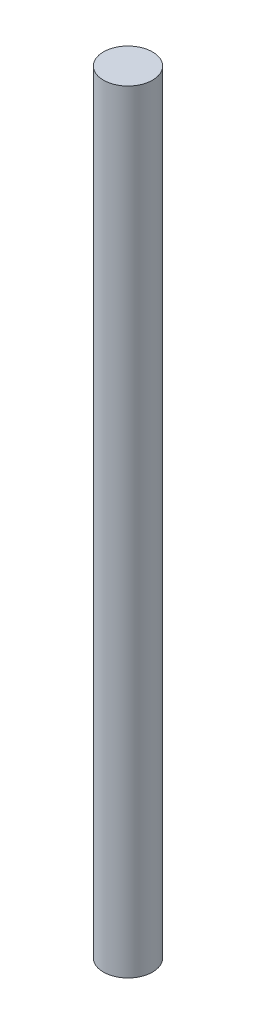
ISO-10303-21;
HEADER;
FILE_DESCRIPTION(('STEP AP214'),'2;1');
FILE_NAME('part.step','',(''),(''),'','','');
FILE_SCHEMA(('AUTOMOTIVE_DESIGN { 1 0 10303 214 1 1 1 1 }'));
ENDSEC;
DATA;
#1=APPLICATION_CONTEXT('core data for automotive mechanical design processes');
#2=APPLICATION_PROTOCOL_DEFINITION('international standard','automotive_design',2000,#1);
#3=PRODUCT_CONTEXT('',#1,'mechanical');
#4=PRODUCT('Part','Part','',(#3));
#5=PRODUCT_RELATED_PRODUCT_CATEGORY('part','',(#4));
#6=PRODUCT_DEFINITION_FORMATION('','',#4);
#7=PRODUCT_DEFINITION_CONTEXT('part definition',#1,'design');
#8=PRODUCT_DEFINITION('design','',#6,#7);
#9=PRODUCT_DEFINITION_SHAPE('','',#8);
#10=(LENGTH_UNIT() NAMED_UNIT(*) SI_UNIT(.MILLI.,.METRE.));
#11=(NAMED_UNIT(*) PLANE_ANGLE_UNIT() SI_UNIT($,.RADIAN.));
#12=(NAMED_UNIT(*) SI_UNIT($,.STERADIAN.) SOLID_ANGLE_UNIT());
#13=UNCERTAINTY_MEASURE_WITH_UNIT(LENGTH_MEASURE(1.E-05),#10,'distance_accuracy_value','');
#14=(GEOMETRIC_REPRESENTATION_CONTEXT(3) GLOBAL_UNCERTAINTY_ASSIGNED_CONTEXT((#13)) GLOBAL_UNIT_ASSIGNED_CONTEXT((#10,
#11,#12)) REPRESENTATION_CONTEXT('',''));
#15=CARTESIAN_POINT('',(0.,0.,0.));
#16=DIRECTION('',(0.,0.,1.));
#17=DIRECTION('',(1.,0.,0.));
#18=AXIS2_PLACEMENT_3D('',#15,#16,#17);
#19=CARTESIAN_POINT('',(0.,100.,0.));
#20=DIRECTION('',(0.,-1.,0.));
#21=DIRECTION('',(0.,0.,-1.));
#22=AXIS2_PLACEMENT_3D('',#19,#20,#21);
#23=CYLINDRICAL_SURFACE('',#22,3.175);
#24=CARTESIAN_POINT('',(0.,100.,0.));
#25=DIRECTION('',(0.,1.,0.));
#26=DIRECTION('',(0.,0.,1.));
#27=AXIS2_PLACEMENT_3D('',#24,#25,#26);
#28=CIRCLE('',#27,3.175);
#29=CARTESIAN_POINT('',(0.,100.,3.175));
#30=VERTEX_POINT('',#29);
#31=EDGE_CURVE('E10',#30,#30,#28,.T.);
#32=ORIENTED_EDGE('',*,*,#31,.F.);
#33=EDGE_LOOP('',(#32));
#34=FACE_BOUND('',#33,.T.);
#35=CARTESIAN_POINT('',(0.,0.,0.));
#36=DIRECTION('',(0.,1.,0.));
#37=DIRECTION('',(0.,0.,1.));
#38=AXIS2_PLACEMENT_3D('',#35,#36,#37);
#39=CIRCLE('',#38,3.175);
#40=CARTESIAN_POINT('',(0.,0.,3.175));
#41=VERTEX_POINT('',#40);
#42=EDGE_CURVE('E40',#41,#41,#39,.T.);
#43=ORIENTED_EDGE('',*,*,#42,.T.);
#44=EDGE_LOOP('',(#43));
#45=FACE_BOUND('',#44,.T.);
#46=ADVANCED_FACE('F37',(#34,#45),#23,.T.);
#47=CARTESIAN_POINT('',(0.,100.,0.));
#48=DIRECTION('',(0.,1.,0.));
#49=DIRECTION('',(0.,0.,1.));
#50=AXIS2_PLACEMENT_3D('',#47,#48,#49);
#51=PLANE('',#50);
#52=ORIENTED_EDGE('',*,*,#31,.T.);
#53=EDGE_LOOP('',(#52));
#54=FACE_BOUND('',#53,.T.);
#55=ADVANCED_FACE('F52',(#54),#51,.T.);
#56=CARTESIAN_POINT('',(0.,0.,0.));
#57=DIRECTION('',(0.,1.,0.));
#58=DIRECTION('',(0.,0.,1.));
#59=AXIS2_PLACEMENT_3D('',#56,#57,#58);
#60=PLANE('',#59);
#61=ORIENTED_EDGE('',*,*,#42,.F.);
#62=EDGE_LOOP('',(#61));
#63=FACE_BOUND('',#62,.T.);
#64=ADVANCED_FACE('F50',(#63),#60,.F.);
#65=CLOSED_SHELL('',(#46,#55,#64));
#66=MANIFOLD_SOLID_BREP('B2',#65);
#67=ADVANCED_BREP_SHAPE_REPRESENTATION('',(#18,#66),#14);
#68=SHAPE_DEFINITION_REPRESENTATION(#9,#67);
ENDSEC;
END-ISO-10303-21;
